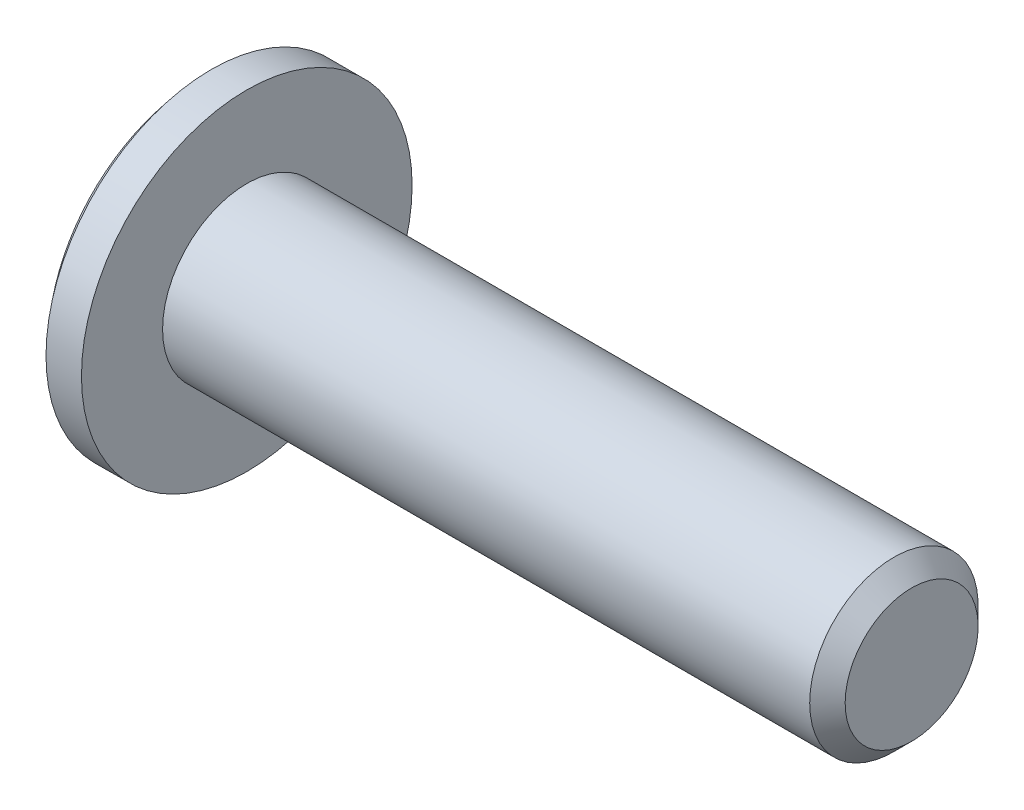
ISO-10303-21;
HEADER;
FILE_DESCRIPTION(('STEP AP214'),'2;1');
FILE_NAME('part.step','',(''),(''),'','','');
FILE_SCHEMA(('AUTOMOTIVE_DESIGN { 1 0 10303 214 1 1 1 1 }'));
ENDSEC;
DATA;
#1=APPLICATION_CONTEXT('core data for automotive mechanical design processes');
#2=APPLICATION_PROTOCOL_DEFINITION('international standard','automotive_design',2000,#1);
#3=PRODUCT_CONTEXT('',#1,'mechanical');
#4=PRODUCT('Part','Part','',(#3));
#5=PRODUCT_RELATED_PRODUCT_CATEGORY('part','',(#4));
#6=PRODUCT_DEFINITION_FORMATION('','',#4);
#7=PRODUCT_DEFINITION_CONTEXT('part definition',#1,'design');
#8=PRODUCT_DEFINITION('design','',#6,#7);
#9=PRODUCT_DEFINITION_SHAPE('','',#8);
#10=(LENGTH_UNIT() NAMED_UNIT(*) SI_UNIT(.MILLI.,.METRE.));
#11=(NAMED_UNIT(*) PLANE_ANGLE_UNIT() SI_UNIT($,.RADIAN.));
#12=(NAMED_UNIT(*) SI_UNIT($,.STERADIAN.) SOLID_ANGLE_UNIT());
#13=UNCERTAINTY_MEASURE_WITH_UNIT(LENGTH_MEASURE(1.E-05),#10,'distance_accuracy_value','');
#14=(GEOMETRIC_REPRESENTATION_CONTEXT(3) GLOBAL_UNCERTAINTY_ASSIGNED_CONTEXT((#13)) GLOBAL_UNIT_ASSIGNED_CONTEXT((#10,
#11,#12)) REPRESENTATION_CONTEXT('',''));
#15=CARTESIAN_POINT('',(0.,0.,0.));
#16=DIRECTION('',(0.,0.,1.));
#17=DIRECTION('',(1.,0.,0.));
#18=AXIS2_PLACEMENT_3D('',#15,#16,#17);
#19=CARTESIAN_POINT('',(0.17730766,1.529216048,1.070340745));
#20=DIRECTION('',(0.,-0.996211045461693,-0.0869686891939914));
#21=DIRECTION('',(0.,0.0869686891939914,-0.996211045461693));
#22=AXIS2_PLACEMENT_3D('',#19,#20,#21);
#23=PLANE('',#22);
#24=DIRECTION('',(0.,0.0869686895242326,-0.996211045432863));
#25=VECTOR('',#24,1.);
#26=CARTESIAN_POINT('',(1.27,1.52921604737888,1.07034074402145));
#27=LINE('',#26,#25);
#28=CARTESIAN_POINT('',(1.27,1.52921604763173,1.07034074517181));
#29=VERTEX_POINT('',#28);
#30=CARTESIAN_POINT('',(1.27,1.69155029995975,-0.789169573028175));
#31=VERTEX_POINT('',#30);
#32=EDGE_CURVE('E92',#29,#31,#27,.T.);
#33=ORIENTED_EDGE('',*,*,#32,.F.);
#34=DIRECTION('',(-1.,0.,0.));
#35=VECTOR('',#34,1.);
#36=CARTESIAN_POINT('',(0.72365383,1.529216048,1.070340745));
#37=LINE('',#36,#35);
#38=CARTESIAN_POINT('',(0.246179484787335,1.52921605413587,1.07034074900731));
#39=VERTEX_POINT('',#38);
#40=EDGE_CURVE('E85',#29,#39,#37,.T.);
#41=ORIENTED_EDGE('',*,*,#40,.T.);
#42=CARTESIAN_POINT('',(0.246179484750848,1.52921604674959,1.07034075932319));
#43=CARTESIAN_POINT('',(0.222220185811176,1.54472947197483,0.892637200656809));
#44=CARTESIAN_POINT('',(0.205155534941156,1.56032466586939,0.713996996258388));
#45=CARTESIAN_POINT('',(0.18490236413316,1.59150336981716,0.356850423810193));
#46=CARTESIAN_POINT('',(0.181643622881486,1.6070865349351,0.178348006933269));
#47=CARTESIAN_POINT('',(0.187903341892022,1.63415512037541,-0.13171788057844));
#48=CARTESIAN_POINT('',(0.194303892747096,1.64564666789267,-0.263351537153461));
#49=CARTESIAN_POINT('',(0.214597130606471,1.66862331011632,-0.526544934489376));
#50=CARTESIAN_POINT('',(0.228518039157927,1.68010821632644,-0.658102516058693));
#51=CARTESIAN_POINT('',(0.246179484854906,1.69155030129401,-0.789169587822688));
#52=B_SPLINE_CURVE_WITH_KNOTS('',3,(#42,#43,#44,#45,#46,#47,#48,#49,#50,#51),.UNSPECIFIED.,.F.,
.F.,(4,2,2,2,4),(0.,0.539840331371772,1.07693153909327,1.47359710157764,1.87176167227616),.UNSPECIFIED.);
#53=CARTESIAN_POINT('',(0.246179483016702,1.69155030588083,-0.789169568883846));
#54=VERTEX_POINT('',#53);
#55=EDGE_CURVE('E20',#39,#54,#52,.T.);
#56=ORIENTED_EDGE('',*,*,#55,.T.);
#57=DIRECTION('',(1.,0.,0.));
#58=VECTOR('',#57,1.);
#59=CARTESIAN_POINT('',(0.72365383,1.6915503,-0.789169573));
#60=LINE('',#59,#58);
#61=EDGE_CURVE('E68',#54,#31,#60,.T.);
#62=ORIENTED_EDGE('',*,*,#61,.T.);
#63=EDGE_LOOP('',(#33,#41,#56,#62));
#64=FACE_BOUND('',#63,.T.);
#65=ADVANCED_FACE('F16',(#64),#23,.T.);
#66=CARTESIAN_POINT('',(0.17730766,-1.529216048,-1.070340745));
#67=DIRECTION('',(0.,0.996211045461693,0.0869686891939914));
#68=DIRECTION('',(0.,-0.0869686891939914,0.996211045461693));
#69=AXIS2_PLACEMENT_3D('',#66,#67,#68);
#70=PLANE('',#69);
#71=DIRECTION('',(0.,-0.0869686895242326,0.996211045432863));
#72=VECTOR('',#71,1.);
#73=CARTESIAN_POINT('',(1.27,-1.52921604737888,-1.07034074402145));
#74=LINE('',#73,#72);
#75=CARTESIAN_POINT('',(1.27,-1.52921604763173,-1.07034074517181));
#76=VERTEX_POINT('',#75);
#77=CARTESIAN_POINT('',(1.27,-1.69155029995975,0.789169573028175));
#78=VERTEX_POINT('',#77);
#79=EDGE_CURVE('E182',#76,#78,#74,.T.);
#80=ORIENTED_EDGE('',*,*,#79,.F.);
#81=DIRECTION('',(-1.,0.,0.));
#82=VECTOR('',#81,1.);
#83=CARTESIAN_POINT('',(0.72365383,-1.529216048,-1.070340745));
#84=LINE('',#83,#82);
#85=CARTESIAN_POINT('',(0.246179484787335,-1.52921605400648,-1.07034074919217));
#86=VERTEX_POINT('',#85);
#87=EDGE_CURVE('E187',#76,#86,#84,.T.);
#88=ORIENTED_EDGE('',*,*,#87,.T.);
#89=CARTESIAN_POINT('',(0.246179484785819,-1.52921604672694,-1.07034075958275));
#90=CARTESIAN_POINT('',(0.222220185823404,-1.54472947196246,-0.892637200798495));
#91=CARTESIAN_POINT('',(0.205155534939876,-1.56032466586745,-0.713996996280596));
#92=CARTESIAN_POINT('',(0.184902364123409,-1.59150336983605,-0.356850423593757));
#93=CARTESIAN_POINT('',(0.181643622876635,-1.60708653496439,-0.178348006597674));
#94=CARTESIAN_POINT('',(0.187903341906995,-1.634155120403,0.131717880894423));
#95=CARTESIAN_POINT('',(0.194303892760036,-1.64564666790819,0.263351537331302));
#96=CARTESIAN_POINT('',(0.214597130599663,-1.66862331010773,0.526544934391009));
#97=CARTESIAN_POINT('',(0.228518039133312,-1.6801082163058,0.658102515822269));
#98=CARTESIAN_POINT('',(0.246179484804624,-1.69155030126143,0.789169587449492));
#99=B_SPLINE_CURVE_WITH_KNOTS('',3,(#89,#90,#91,#92,#93,#94,#95,#96,#97,#98),.UNSPECIFIED.,.F.,
.F.,(4,2,2,2,4),(0.,0.53984033173261,1.07693153981145,1.47359710188071,1.87176167216087),.UNSPECIFIED.);
#100=CARTESIAN_POINT('',(0.246179483041842,-1.69155030603428,0.789169568776439));
#101=VERTEX_POINT('',#100);
#102=EDGE_CURVE('E94',#86,#101,#99,.T.);
#103=ORIENTED_EDGE('',*,*,#102,.T.);
#104=DIRECTION('',(1.,0.,0.));
#105=VECTOR('',#104,1.);
#106=CARTESIAN_POINT('',(0.72365383,-1.6915503,0.789169573));
#107=LINE('',#106,#105);
#108=EDGE_CURVE('E97',#101,#78,#107,.T.);
#109=ORIENTED_EDGE('',*,*,#108,.T.);
#110=EDGE_LOOP('',(#80,#88,#103,#109));
#111=FACE_BOUND('',#110,.T.);
#112=ADVANCED_FACE('F193',(#111),#70,.T.);
#113=CARTESIAN_POINT('',(1.27,-1.6915503,-1.859510318));
#114=DIRECTION('',(-1.,0.,0.));
#115=DIRECTION('',(0.,0.,1.));
#116=AXIS2_PLACEMENT_3D('',#113,#114,#115);
#117=PLANE('',#116);
#118=DIRECTION('',(0.,0.906228417470707,-0.422788428612394));
#119=VECTOR('',#118,1.);
#120=CARTESIAN_POINT('',(1.27,-0.683440898,-1.4649255315));
#121=LINE('',#120,#119);
#122=CARTESIAN_POINT('',(1.27,0.162334252,-1.859510318));
#123=VERTEX_POINT('',#122);
#124=EDGE_CURVE('E164',#76,#123,#121,.T.);
#125=ORIENTED_EDGE('',*,*,#124,.F.);
#126=ORIENTED_EDGE('',*,*,#79,.T.);
#127=DIRECTION('',(0.,-0.819259728340041,-0.573422616854448));
#128=VECTOR('',#127,1.);
#129=CARTESIAN_POINT('',(1.27,-0.926942276,1.3243399455));
#130=LINE('',#129,#128);
#131=CARTESIAN_POINT('',(1.27,-0.162334252,1.859510318));
#132=VERTEX_POINT('',#131);
#133=EDGE_CURVE('E179',#132,#78,#130,.T.);
#134=ORIENTED_EDGE('',*,*,#133,.F.);
#135=DIRECTION('',(0.,-0.906228417470707,0.422788428612394));
#136=VECTOR('',#135,1.);
#137=CARTESIAN_POINT('',(1.27,0.683440898,1.4649255315));
#138=LINE('',#137,#136);
#139=EDGE_CURVE('E169',#29,#132,#138,.T.);
#140=ORIENTED_EDGE('',*,*,#139,.F.);
#141=ORIENTED_EDGE('',*,*,#32,.T.);
#142=DIRECTION('',(0.,0.819259728340041,0.573422616854448));
#143=VECTOR('',#142,1.);
#144=CARTESIAN_POINT('',(1.27,0.926942276,-1.3243399455));
#145=LINE('',#144,#143);
#146=EDGE_CURVE('E168',#123,#31,#145,.T.);
#147=ORIENTED_EDGE('',*,*,#146,.F.);
#148=EDGE_LOOP('',(#125,#126,#134,#140,#141,#147));
#149=FACE_BOUND('',#148,.T.);
#150=ADVANCED_FACE('F198',(#149),#117,.T.);
#151=CARTESIAN_POINT('',(0.17730766,-1.6915503,0.789169573));
#152=DIRECTION('',(0.,0.573422616854448,-0.819259728340041));
#153=DIRECTION('',(0.,0.819259728340041,0.573422616854448));
#154=AXIS2_PLACEMENT_3D('',#151,#152,#153);
#155=PLANE('',#154);
#156=ORIENTED_EDGE('',*,*,#133,.T.);
#157=ORIENTED_EDGE('',*,*,#108,.F.);
#158=CARTESIAN_POINT('',(0.24617948483504,-1.69155031206856,0.789169564552879));
#159=CARTESIAN_POINT('',(0.23004767533873,-1.59307594447616,0.858094506918024));
#160=CARTESIAN_POINT('',(0.217034101797753,-1.49427959323899,0.927244814570609));
#161=CARTESIAN_POINT('',(0.197271398991174,-1.29625839369965,1.06584534686161));
#162=CARTESIAN_POINT('',(0.190522830355285,-1.19703350784769,1.13529559778215));
#163=CARTESIAN_POINT('',(0.179772082862811,-0.90049981775156,1.34284775575891));
#164=CARTESIAN_POINT('',(0.185031755711426,-0.702903646909321,1.48115079867102));
#165=CARTESIAN_POINT('',(0.212948723754088,-0.391164560862013,1.6993456351965));
#166=CARTESIAN_POINT('',(0.22745977842691,-0.276495133701073,1.77960594913754));
#167=CARTESIAN_POINT('',(0.246179484862095,-0.162334239652964,1.85951032664203));
#168=B_SPLINE_CURVE_WITH_KNOTS('',3,(#158,#159,#160,#161,#162,#163,#164,#165,#166,#167),
.UNSPECIFIED.,.F.,.F.,(4,2,2,2,4),(0.,0.36373941970367,0.727511385826355,1.44980341767306,
1.87166801930788),.UNSPECIFIED.);
#169=CARTESIAN_POINT('',(0.246179483055371,-0.162334245826472,1.85951032232102));
#170=VERTEX_POINT('',#169);
#171=EDGE_CURVE('E89',#101,#170,#168,.T.);
#172=ORIENTED_EDGE('',*,*,#171,.T.);
#173=DIRECTION('',(-1.,0.,0.));
#174=VECTOR('',#173,1.);
#175=CARTESIAN_POINT('',(0.72365383,-0.162334252,1.859510318));
#176=LINE('',#175,#174);
#177=EDGE_CURVE('E88',#132,#170,#176,.T.);
#178=ORIENTED_EDGE('',*,*,#177,.F.);
#179=EDGE_LOOP('',(#156,#157,#172,#178));
#180=FACE_BOUND('',#179,.T.);
#181=ADVANCED_FACE('F201',(#180),#155,.T.);
#182=CARTESIAN_POINT('',(0.17730766,-0.162334252,1.859510318));
#183=DIRECTION('',(0.,-0.422788428612394,-0.906228417470707));
#184=DIRECTION('',(0.,0.906228417470707,-0.422788428612394));
#185=AXIS2_PLACEMENT_3D('',#182,#183,#184);
#186=PLANE('',#185);
#187=ORIENTED_EDGE('',*,*,#139,.T.);
#188=ORIENTED_EDGE('',*,*,#177,.T.);
#189=CARTESIAN_POINT('',(0.246179484744734,-0.162334264865353,1.85951032400216));
#190=CARTESIAN_POINT('',(0.230047675256585,-0.05340633002567,1.80869149122774));
#191=CARTESIAN_POINT('',(0.217034101723777,0.0558777687002443,1.75770649508118));
#192=CARTESIAN_POINT('',(0.197271398933531,0.274919950412977,1.65551537193738));
#193=CARTESIAN_POINT('',(0.190522830305807,0.384678074935675,1.60430922556216));
#194=CARTESIAN_POINT('',(0.179772082837661,0.712690361402745,1.45127959584912));
#195=CARTESIAN_POINT('',(0.185031755702455,0.931262395406439,1.34930781366538));
#196=CARTESIAN_POINT('',(0.212948723757145,1.27609420966791,1.1884312641371));
#197=CARTESIAN_POINT('',(0.227459778414825,1.40293639387058,1.12925478422656));
#198=CARTESIAN_POINT('',(0.246179484823818,1.52921606152212,1.07034073869144));
#199=B_SPLINE_CURVE_WITH_KNOTS('',3,(#189,#190,#191,#192,#193,#194,#195,#196,#197,#198),
.UNSPECIFIED.,.F.,.F.,(4,2,2,2,4),(0.,0.363739419703233,0.727511385825564,1.44980341767298,
1.871668018756),.UNSPECIFIED.);
#200=EDGE_CURVE('E77',#170,#39,#199,.T.);
#201=ORIENTED_EDGE('',*,*,#200,.T.);
#202=ORIENTED_EDGE('',*,*,#40,.F.);
#203=EDGE_LOOP('',(#187,#188,#201,#202));
#204=FACE_BOUND('',#203,.T.);
#205=ADVANCED_FACE('F84',(#204),#186,.T.);
#206=CARTESIAN_POINT('',(0.17730766,1.6915503,-0.789169573));
#207=DIRECTION('',(0.,-0.573422616854448,0.819259728340041));
#208=DIRECTION('',(0.,-0.819259728340041,-0.573422616854448));
#209=AXIS2_PLACEMENT_3D('',#206,#207,#208);
#210=PLANE('',#209);
#211=ORIENTED_EDGE('',*,*,#146,.T.);
#212=ORIENTED_EDGE('',*,*,#61,.F.);
#213=CARTESIAN_POINT('',(0.246179484784759,1.69155031176166,-0.789169564767692));
#214=CARTESIAN_POINT('',(0.230047675294945,1.59307594416866,-0.85809450713325));
#215=CARTESIAN_POINT('',(0.217034101760477,1.49427959293106,-0.927244814786144));
#216=CARTESIAN_POINT('',(0.197271398966928,1.29625839339108,-1.06584534707759));
#217=CARTESIAN_POINT('',(0.19052283033756,1.19703350753893,-1.13529559799826));
#218=CARTESIAN_POINT('',(0.179772082864536,0.900499817442172,-1.34284775597546));
#219=CARTESIAN_POINT('',(0.185031755726133,0.702903646599867,-1.48115079888761));
#220=CARTESIAN_POINT('',(0.212948723773695,0.391164560728217,-1.69934563529014));
#221=CARTESIAN_POINT('',(0.227459778425625,0.276495133741717,-1.77960594910909));
#222=CARTESIAN_POINT('',(0.246179484827124,0.16233423986642,-1.85951032649263));
#223=B_SPLINE_CURVE_WITH_KNOTS('',3,(#213,#214,#215,#216,#217,#218,#219,#220,#221,#222),
.UNSPECIFIED.,.F.,.F.,(4,2,2,2,4),(0.,0.363739419703197,0.727511385825506,1.44980341767305,
1.87166801866731),.UNSPECIFIED.);
#224=CARTESIAN_POINT('',(0.246179483037886,0.1623342459332,-1.85951032224632));
#225=VERTEX_POINT('',#224);
#226=EDGE_CURVE('E40',#54,#225,#223,.T.);
#227=ORIENTED_EDGE('',*,*,#226,.T.);
#228=DIRECTION('',(-1.,0.,0.));
#229=VECTOR('',#228,1.);
#230=CARTESIAN_POINT('',(0.72365383,0.162334252,-1.859510318));
#231=LINE('',#230,#229);
#232=EDGE_CURVE('E162',#123,#225,#231,.T.);
#233=ORIENTED_EDGE('',*,*,#232,.F.);
#234=EDGE_LOOP('',(#211,#212,#227,#233));
#235=FACE_BOUND('',#234,.T.);
#236=ADVANCED_FACE('F126',(#235),#210,.T.);
#237=CARTESIAN_POINT('',(0.17730766,0.162334252,-1.859510318));
#238=DIRECTION('',(0.,0.422788428612394,0.906228417470707));
#239=DIRECTION('',(0.,-0.906228417470707,0.422788428612394));
#240=AXIS2_PLACEMENT_3D('',#237,#238,#239);
#241=PLANE('',#240);
#242=ORIENTED_EDGE('',*,*,#124,.T.);
#243=ORIENTED_EDGE('',*,*,#232,.T.);
#244=CARTESIAN_POINT('',(0.246179484779705,0.162334265101469,-1.85951032411231));
#245=CARTESIAN_POINT('',(0.230047675287053,0.0534063302623331,-1.80869149133815));
#246=CARTESIAN_POINT('',(0.217034101749726,-0.0558777684631396,-1.7577064951918));
#247=CARTESIAN_POINT('',(0.197271398950423,-0.274919950175201,-1.65551537204831));
#248=CARTESIAN_POINT('',(0.19052283031816,-0.38467807469767,-1.60430922567319));
#249=CARTESIAN_POINT('',(0.179772082836451,-0.712690361164374,-1.45127959596033));
#250=CARTESIAN_POINT('',(0.185031755692209,-0.931262395168246,-1.34930781377651));
#251=CARTESIAN_POINT('',(0.21294872373264,-1.27609420943067,-1.18843126424778));
#252=CARTESIAN_POINT('',(0.227459778385076,-1.40293639363383,-1.12925478433701));
#253=CARTESIAN_POINT('',(0.246179484788847,-1.529216061286,-1.0703407388016));
#254=B_SPLINE_CURVE_WITH_KNOTS('',3,(#244,#245,#246,#247,#248,#249,#250,#251,#252,#253),
.UNSPECIFIED.,.F.,.F.,(4,2,2,2,4),(0.,0.363739419703232,0.727511385825563,1.44980341767297,
1.87166801875599),.UNSPECIFIED.);
#255=EDGE_CURVE('E109',#225,#86,#254,.T.);
#256=ORIENTED_EDGE('',*,*,#255,.T.);
#257=ORIENTED_EDGE('',*,*,#87,.F.);
#258=EDGE_LOOP('',(#242,#243,#256,#257));
#259=FACE_BOUND('',#258,.T.);
#260=ADVANCED_FACE('F123',(#259),#241,.T.);
#261=CARTESIAN_POINT('',(7.199493929,0.,0.));
#262=DIRECTION('',(-1.,0.,0.));
#263=DIRECTION('',(0.,-1.,0.));
#264=AXIS2_PLACEMENT_3D('',#261,#262,#263);
#265=SPHERICAL_SURFACE('',#264,7.199493928);
#266=ORIENTED_EDGE('',*,*,#55,.F.);
#267=ORIENTED_EDGE('',*,*,#200,.F.);
#268=ORIENTED_EDGE('',*,*,#171,.F.);
#269=ORIENTED_EDGE('',*,*,#102,.F.);
#270=ORIENTED_EDGE('',*,*,#255,.F.);
#271=ORIENTED_EDGE('',*,*,#226,.F.);
#272=EDGE_LOOP('',(#266,#267,#268,#269,#270,#271));
#273=FACE_BOUND('',#272,.T.);
#274=CARTESIAN_POINT('',(1.778,0.,0.));
#275=DIRECTION('',(-1.,0.,0.));
#276=DIRECTION('',(0.,0.,1.));
#277=AXIS2_PLACEMENT_3D('',#274,#275,#276);
#278=CIRCLE('',#277,4.7371);
#279=CARTESIAN_POINT('',(1.778,0.,4.7371));
#280=VERTEX_POINT('',#279);
#281=EDGE_CURVE('E108',#280,#280,#278,.T.);
#282=ORIENTED_EDGE('',*,*,#281,.T.);
#283=EDGE_LOOP('',(#282));
#284=FACE_BOUND('',#283,.T.);
#285=ADVANCED_FACE('F74',(#273,#284),#265,.T.);
#286=CARTESIAN_POINT('',(2.794,0.,0.));
#287=DIRECTION('',(-1.,0.,0.));
#288=DIRECTION('',(0.,-1.,0.));
#289=AXIS2_PLACEMENT_3D('',#286,#287,#288);
#290=CYLINDRICAL_SURFACE('',#289,4.7371);
#291=ORIENTED_EDGE('',*,*,#281,.F.);
#292=EDGE_LOOP('',(#291));
#293=FACE_BOUND('',#292,.T.);
#294=CARTESIAN_POINT('',(2.794,0.,0.));
#295=DIRECTION('',(-1.,0.,0.));
#296=DIRECTION('',(0.,-1.,0.));
#297=AXIS2_PLACEMENT_3D('',#294,#295,#296);
#298=CIRCLE('',#297,4.7371);
#299=CARTESIAN_POINT('',(2.794,-4.7371,0.));
#300=VERTEX_POINT('',#299);
#301=EDGE_CURVE('E105',#300,#300,#298,.T.);
#302=ORIENTED_EDGE('',*,*,#301,.T.);
#303=EDGE_LOOP('',(#302));
#304=FACE_BOUND('',#303,.T.);
#305=ADVANCED_FACE('F133',(#293,#304),#290,.T.);
#306=CARTESIAN_POINT('',(2.794,-4.7939452,-4.7939452));
#307=DIRECTION('',(-1.,0.,0.));
#308=DIRECTION('',(0.,0.,1.));
#309=AXIS2_PLACEMENT_3D('',#306,#307,#308);
#310=PLANE('',#309);
#311=CARTESIAN_POINT('',(2.794,0.,0.));
#312=DIRECTION('',(-1.,0.,0.));
#313=DIRECTION('',(0.,0.,1.));
#314=AXIS2_PLACEMENT_3D('',#311,#312,#313);
#315=CIRCLE('',#314,2.413);
#316=CARTESIAN_POINT('',(2.794,0.,2.413));
#317=VERTEX_POINT('',#316);
#318=EDGE_CURVE('E102',#317,#317,#315,.T.);
#319=ORIENTED_EDGE('',*,*,#318,.T.);
#320=EDGE_LOOP('',(#319));
#321=FACE_BOUND('',#320,.T.);
#322=ORIENTED_EDGE('',*,*,#301,.F.);
#323=EDGE_LOOP('',(#322));
#324=FACE_BOUND('',#323,.T.);
#325=ADVANCED_FACE('F130',(#321,#324),#310,.F.);
#326=CARTESIAN_POINT('',(21.336,0.,0.));
#327=DIRECTION('',(-1.,0.,0.));
#328=DIRECTION('',(0.,0.,1.));
#329=AXIS2_PLACEMENT_3D('',#326,#327,#328);
#330=CYLINDRICAL_SURFACE('',#329,2.413);
#331=ORIENTED_EDGE('',*,*,#318,.F.);
#332=EDGE_LOOP('',(#331));
#333=FACE_BOUND('',#332,.T.);
#334=CARTESIAN_POINT('',(21.336,0.,0.));
#335=DIRECTION('',(-1.,0.,0.));
#336=DIRECTION('',(0.,0.,1.));
#337=AXIS2_PLACEMENT_3D('',#334,#335,#336);
#338=CIRCLE('',#337,2.413);
#339=CARTESIAN_POINT('',(21.336,0.,2.413));
#340=VERTEX_POINT('',#339);
#341=EDGE_CURVE('E31',#340,#340,#338,.T.);
#342=ORIENTED_EDGE('',*,*,#341,.T.);
#343=EDGE_LOOP('',(#342));
#344=FACE_BOUND('',#343,.T.);
#345=ADVANCED_FACE('F132',(#333,#344),#330,.T.);
#346=CARTESIAN_POINT('',(21.844,-1.92786,-1.92786));
#347=DIRECTION('',(-1.,0.,0.));
#348=DIRECTION('',(0.,0.,1.));
#349=AXIS2_PLACEMENT_3D('',#346,#347,#348);
#350=PLANE('',#349);
#351=CARTESIAN_POINT('',(21.844,0.,0.));
#352=DIRECTION('',(-1.,0.,0.));
#353=DIRECTION('',(0.,0.,1.));
#354=AXIS2_PLACEMENT_3D('',#351,#352,#353);
#355=CIRCLE('',#354,1.90500000000003);
#356=CARTESIAN_POINT('',(21.844,0.,1.90500000000003));
#357=VERTEX_POINT('',#356);
#358=EDGE_CURVE('E10',#357,#357,#355,.F.);
#359=ORIENTED_EDGE('',*,*,#358,.T.);
#360=EDGE_LOOP('',(#359));
#361=FACE_BOUND('',#360,.T.);
#362=ADVANCED_FACE('F18',(#361),#350,.F.);
#363=CARTESIAN_POINT('',(21.844,0.,0.));
#364=DIRECTION('',(-1.,0.,0.));
#365=DIRECTION('',(0.,0.,1.));
#366=AXIS2_PLACEMENT_3D('',#363,#364,#365);
#367=CONICAL_SURFACE('',#366,1.905,0.785398163397447);
#368=ORIENTED_EDGE('',*,*,#358,.F.);
#369=EDGE_LOOP('',(#368));
#370=FACE_BOUND('',#369,.T.);
#371=ORIENTED_EDGE('',*,*,#341,.F.);
#372=EDGE_LOOP('',(#371));
#373=FACE_BOUND('',#372,.T.);
#374=ADVANCED_FACE('F144',(#370,#373),#367,.T.);
#375=CLOSED_SHELL('',(#65,#112,#150,#181,#205,#236,#260,#285,#305,#325,#345,#362,#374));
#376=MANIFOLD_SOLID_BREP('B1',#375);
#377=ADVANCED_BREP_SHAPE_REPRESENTATION('',(#18,#376),#14);
#378=SHAPE_DEFINITION_REPRESENTATION(#9,#377);
ENDSEC;
END-ISO-10303-21;
